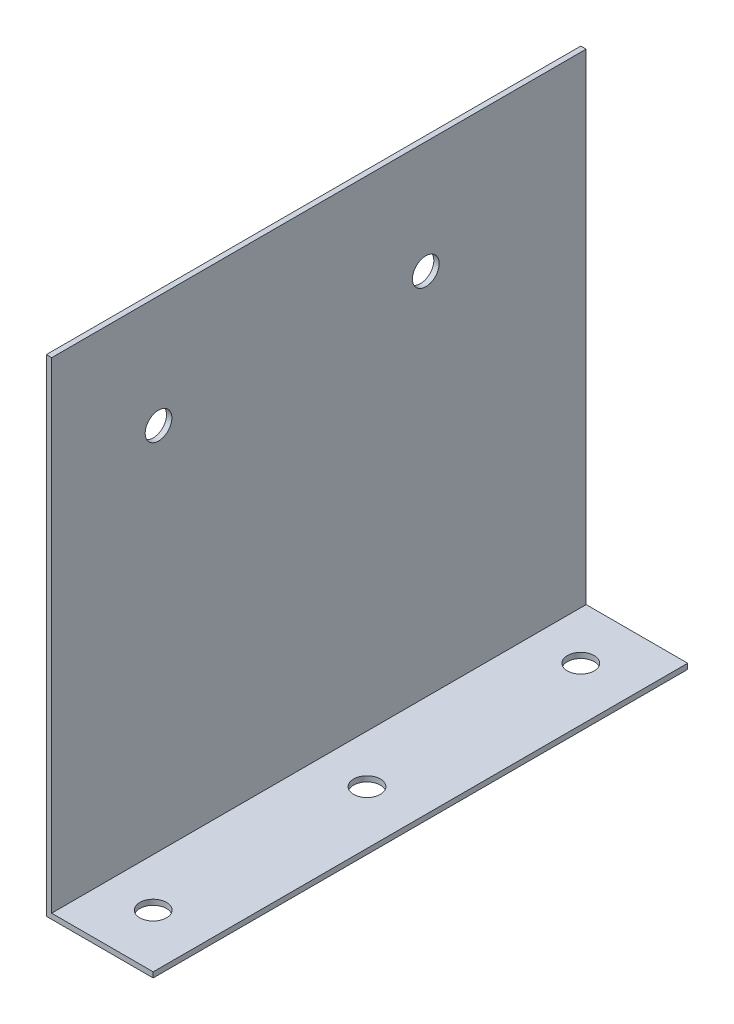
ISO-10303-21;
HEADER;
FILE_DESCRIPTION(('STEP AP214'),'2;1');
FILE_NAME('part.step','',(''),(''),'','','');
FILE_SCHEMA(('AUTOMOTIVE_DESIGN { 1 0 10303 214 1 1 1 1 }'));
ENDSEC;
DATA;
#1=APPLICATION_CONTEXT('core data for automotive mechanical design processes');
#2=APPLICATION_PROTOCOL_DEFINITION('international standard','automotive_design',2000,#1);
#3=PRODUCT_CONTEXT('',#1,'mechanical');
#4=PRODUCT('Part','Part','',(#3));
#5=PRODUCT_RELATED_PRODUCT_CATEGORY('part','',(#4));
#6=PRODUCT_DEFINITION_FORMATION('','',#4);
#7=PRODUCT_DEFINITION_CONTEXT('part definition',#1,'design');
#8=PRODUCT_DEFINITION('design','',#6,#7);
#9=PRODUCT_DEFINITION_SHAPE('','',#8);
#10=(LENGTH_UNIT() NAMED_UNIT(*) SI_UNIT(.MILLI.,.METRE.));
#11=(NAMED_UNIT(*) PLANE_ANGLE_UNIT() SI_UNIT($,.RADIAN.));
#12=(NAMED_UNIT(*) SI_UNIT($,.STERADIAN.) SOLID_ANGLE_UNIT());
#13=UNCERTAINTY_MEASURE_WITH_UNIT(LENGTH_MEASURE(1.E-05),#10,'distance_accuracy_value','');
#14=(GEOMETRIC_REPRESENTATION_CONTEXT(3) GLOBAL_UNCERTAINTY_ASSIGNED_CONTEXT((#13)) GLOBAL_UNIT_ASSIGNED_CONTEXT((#10,
#11,#12)) REPRESENTATION_CONTEXT('',''));
#15=CARTESIAN_POINT('',(0.,0.,0.));
#16=DIRECTION('',(0.,0.,1.));
#17=DIRECTION('',(1.,0.,0.));
#18=AXIS2_PLACEMENT_3D('',#15,#16,#17);
#19=CARTESIAN_POINT('',(0.,1.,0.));
#20=DIRECTION('',(0.,1.,0.));
#21=DIRECTION('',(0.,0.,1.));
#22=AXIS2_PLACEMENT_3D('',#19,#20,#21);
#23=PLANE('',#22);
#24=CARTESIAN_POINT('',(10.,1.,50.));
#25=DIRECTION('',(0.,1.,0.));
#26=DIRECTION('',(0.,0.,1.));
#27=AXIS2_PLACEMENT_3D('',#24,#25,#26);
#28=CIRCLE('',#27,2.5);
#29=CARTESIAN_POINT('',(10.,1.,52.5));
#30=VERTEX_POINT('',#29);
#31=EDGE_CURVE('E121',#30,#30,#28,.T.);
#32=ORIENTED_EDGE('',*,*,#31,.F.);
#33=EDGE_LOOP('',(#32));
#34=FACE_BOUND('',#33,.T.);
#35=CARTESIAN_POINT('',(10.,1.,10.));
#36=DIRECTION('',(0.,1.,0.));
#37=DIRECTION('',(0.,0.,1.));
#38=AXIS2_PLACEMENT_3D('',#35,#36,#37);
#39=CIRCLE('',#38,2.5);
#40=CARTESIAN_POINT('',(10.,1.,12.5));
#41=VERTEX_POINT('',#40);
#42=EDGE_CURVE('E126',#41,#41,#39,.T.);
#43=ORIENTED_EDGE('',*,*,#42,.F.);
#44=EDGE_LOOP('',(#43));
#45=FACE_BOUND('',#44,.T.);
#46=CARTESIAN_POINT('',(10.,1.,90.));
#47=DIRECTION('',(0.,1.,0.));
#48=DIRECTION('',(0.,0.,1.));
#49=AXIS2_PLACEMENT_3D('',#46,#47,#48);
#50=CIRCLE('',#49,2.5);
#51=CARTESIAN_POINT('',(10.,1.,92.5));
#52=VERTEX_POINT('',#51);
#53=EDGE_CURVE('E118',#52,#52,#50,.T.);
#54=ORIENTED_EDGE('',*,*,#53,.F.);
#55=EDGE_LOOP('',(#54));
#56=FACE_BOUND('',#55,.T.);
#57=DIRECTION('',(-1.,0.,0.));
#58=VECTOR('',#57,1.);
#59=CARTESIAN_POINT('',(0.,1.,0.));
#60=LINE('',#59,#58);
#61=CARTESIAN_POINT('',(20.,1.,0.));
#62=VERTEX_POINT('',#61);
#63=CARTESIAN_POINT('',(1.,1.,0.));
#64=VERTEX_POINT('',#63);
#65=EDGE_CURVE('E100',#62,#64,#60,.T.);
#66=ORIENTED_EDGE('',*,*,#65,.T.);
#67=DIRECTION('',(0.,0.,1.));
#68=VECTOR('',#67,1.);
#69=CARTESIAN_POINT('',(1.,1.,0.));
#70=LINE('',#69,#68);
#71=CARTESIAN_POINT('',(1.00000000000001,1.,100.));
#72=VERTEX_POINT('',#71);
#73=EDGE_CURVE('E117',#64,#72,#70,.T.);
#74=ORIENTED_EDGE('',*,*,#73,.T.);
#75=DIRECTION('',(1.,0.,0.));
#76=VECTOR('',#75,1.);
#77=CARTESIAN_POINT('',(0.,1.,100.));
#78=LINE('',#77,#76);
#79=CARTESIAN_POINT('',(20.,1.,100.));
#80=VERTEX_POINT('',#79);
#81=EDGE_CURVE('E90',#72,#80,#78,.T.);
#82=ORIENTED_EDGE('',*,*,#81,.T.);
#83=DIRECTION('',(0.,0.,-1.));
#84=VECTOR('',#83,1.);
#85=CARTESIAN_POINT('',(20.,1.,0.));
#86=LINE('',#85,#84);
#87=EDGE_CURVE('E59',#80,#62,#86,.T.);
#88=ORIENTED_EDGE('',*,*,#87,.T.);
#89=EDGE_LOOP('',(#66,#74,#82,#88));
#90=FACE_BOUND('',#89,.T.);
#91=ADVANCED_FACE('F33',(#34,#45,#56,#90),#23,.T.);
#92=CARTESIAN_POINT('',(0.,1.,0.));
#93=DIRECTION('',(1.,0.,0.));
#94=DIRECTION('',(0.,0.,-1.));
#95=AXIS2_PLACEMENT_3D('',#92,#93,#94);
#96=PLANE('',#95);
#97=CARTESIAN_POINT('',(0.,70.,80.));
#98=DIRECTION('',(1.,0.,0.));
#99=DIRECTION('',(0.,0.,-1.));
#100=AXIS2_PLACEMENT_3D('',#97,#98,#99);
#101=CIRCLE('',#100,2.50000000000001);
#102=CARTESIAN_POINT('',(0.,70.,77.5));
#103=VERTEX_POINT('',#102);
#104=EDGE_CURVE('E282',#103,#103,#101,.T.);
#105=ORIENTED_EDGE('',*,*,#104,.T.);
#106=EDGE_LOOP('',(#105));
#107=FACE_BOUND('',#106,.T.);
#108=CARTESIAN_POINT('',(0.,70.,30.));
#109=DIRECTION('',(1.,0.,0.));
#110=DIRECTION('',(0.,0.,-1.));
#111=AXIS2_PLACEMENT_3D('',#108,#109,#110);
#112=CIRCLE('',#111,2.5);
#113=CARTESIAN_POINT('',(0.,70.,27.5));
#114=VERTEX_POINT('',#113);
#115=EDGE_CURVE('E131',#114,#114,#112,.T.);
#116=ORIENTED_EDGE('',*,*,#115,.T.);
#117=EDGE_LOOP('',(#116));
#118=FACE_BOUND('',#117,.T.);
#119=DIRECTION('',(0.,0.,1.));
#120=VECTOR('',#119,1.);
#121=CARTESIAN_POINT('',(0.,0.,0.));
#122=LINE('',#121,#120);
#123=CARTESIAN_POINT('',(0.,0.,0.));
#124=VERTEX_POINT('',#123);
#125=CARTESIAN_POINT('',(0.,0.,100.));
#126=VERTEX_POINT('',#125);
#127=EDGE_CURVE('E96',#124,#126,#122,.T.);
#128=ORIENTED_EDGE('',*,*,#127,.T.);
#129=DIRECTION('',(0.,-1.,0.));
#130=VECTOR('',#129,1.);
#131=CARTESIAN_POINT('',(0.,1.,100.));
#132=LINE('',#131,#130);
#133=CARTESIAN_POINT('',(0.,91.,100.));
#134=VERTEX_POINT('',#133);
#135=EDGE_CURVE('E11',#134,#126,#132,.T.);
#136=ORIENTED_EDGE('',*,*,#135,.F.);
#137=DIRECTION('',(0.,0.,1.));
#138=VECTOR('',#137,1.);
#139=CARTESIAN_POINT('',(0.,91.,0.));
#140=LINE('',#139,#138);
#141=CARTESIAN_POINT('',(0.,91.,0.));
#142=VERTEX_POINT('',#141);
#143=EDGE_CURVE('E98',#142,#134,#140,.T.);
#144=ORIENTED_EDGE('',*,*,#143,.F.);
#145=DIRECTION('',(0.,-1.,0.));
#146=VECTOR('',#145,1.);
#147=CARTESIAN_POINT('',(0.,1.,0.));
#148=LINE('',#147,#146);
#149=EDGE_CURVE('E83',#142,#124,#148,.T.);
#150=ORIENTED_EDGE('',*,*,#149,.T.);
#151=EDGE_LOOP('',(#128,#136,#144,#150));
#152=FACE_BOUND('',#151,.T.);
#153=ADVANCED_FACE('F35',(#107,#118,#152),#96,.F.);
#154=CARTESIAN_POINT('',(0.,1.,100.));
#155=DIRECTION('',(0.,0.,-1.));
#156=DIRECTION('',(-1.,0.,0.));
#157=AXIS2_PLACEMENT_3D('',#154,#155,#156);
#158=PLANE('',#157);
#159=DIRECTION('',(1.,0.,0.));
#160=VECTOR('',#159,1.);
#161=CARTESIAN_POINT('',(0.,0.,100.));
#162=LINE('',#161,#160);
#163=CARTESIAN_POINT('',(20.,0.,100.));
#164=VERTEX_POINT('',#163);
#165=EDGE_CURVE('E103',#126,#164,#162,.T.);
#166=ORIENTED_EDGE('',*,*,#165,.T.);
#167=DIRECTION('',(0.,-1.,0.));
#168=VECTOR('',#167,1.);
#169=CARTESIAN_POINT('',(20.,1.,100.));
#170=LINE('',#169,#168);
#171=EDGE_CURVE('E42',#80,#164,#170,.T.);
#172=ORIENTED_EDGE('',*,*,#171,.F.);
#173=ORIENTED_EDGE('',*,*,#81,.F.);
#174=DIRECTION('',(0.,-1.,0.));
#175=VECTOR('',#174,1.);
#176=CARTESIAN_POINT('',(1.00000000000001,91.,100.));
#177=LINE('',#176,#175);
#178=CARTESIAN_POINT('',(1.00000000000001,91.,100.));
#179=VERTEX_POINT('',#178);
#180=EDGE_CURVE('E50',#179,#72,#177,.T.);
#181=ORIENTED_EDGE('',*,*,#180,.F.);
#182=DIRECTION('',(1.,0.,0.));
#183=VECTOR('',#182,1.);
#184=CARTESIAN_POINT('',(0.,91.,100.));
#185=LINE('',#184,#183);
#186=EDGE_CURVE('E142',#134,#179,#185,.T.);
#187=ORIENTED_EDGE('',*,*,#186,.F.);
#188=ORIENTED_EDGE('',*,*,#135,.T.);
#189=EDGE_LOOP('',(#166,#172,#173,#181,#187,#188));
#190=FACE_BOUND('',#189,.T.);
#191=ADVANCED_FACE('F176',(#190),#158,.F.);
#192=CARTESIAN_POINT('',(20.,1.,0.));
#193=DIRECTION('',(-1.,0.,0.));
#194=DIRECTION('',(0.,0.,1.));
#195=AXIS2_PLACEMENT_3D('',#192,#193,#194);
#196=PLANE('',#195);
#197=DIRECTION('',(0.,0.,-1.));
#198=VECTOR('',#197,1.);
#199=CARTESIAN_POINT('',(20.,0.,0.));
#200=LINE('',#199,#198);
#201=CARTESIAN_POINT('',(20.,0.,0.));
#202=VERTEX_POINT('',#201);
#203=EDGE_CURVE('E91',#164,#202,#200,.T.);
#204=ORIENTED_EDGE('',*,*,#203,.T.);
#205=DIRECTION('',(0.,-1.,0.));
#206=VECTOR('',#205,1.);
#207=CARTESIAN_POINT('',(20.,1.,0.));
#208=LINE('',#207,#206);
#209=EDGE_CURVE('E86',#62,#202,#208,.T.);
#210=ORIENTED_EDGE('',*,*,#209,.F.);
#211=ORIENTED_EDGE('',*,*,#87,.F.);
#212=ORIENTED_EDGE('',*,*,#171,.T.);
#213=EDGE_LOOP('',(#204,#210,#211,#212));
#214=FACE_BOUND('',#213,.T.);
#215=ADVANCED_FACE('F182',(#214),#196,.F.);
#216=CARTESIAN_POINT('',(0.,1.,0.));
#217=DIRECTION('',(0.,0.,1.));
#218=DIRECTION('',(1.,0.,0.));
#219=AXIS2_PLACEMENT_3D('',#216,#217,#218);
#220=PLANE('',#219);
#221=DIRECTION('',(-1.,0.,0.));
#222=VECTOR('',#221,1.);
#223=CARTESIAN_POINT('',(0.,0.,0.));
#224=LINE('',#223,#222);
#225=EDGE_CURVE('E79',#202,#124,#224,.T.);
#226=ORIENTED_EDGE('',*,*,#225,.T.);
#227=ORIENTED_EDGE('',*,*,#149,.F.);
#228=DIRECTION('',(1.,0.,0.));
#229=VECTOR('',#228,1.);
#230=CARTESIAN_POINT('',(0.,91.,0.));
#231=LINE('',#230,#229);
#232=CARTESIAN_POINT('',(1.,91.,0.));
#233=VERTEX_POINT('',#232);
#234=EDGE_CURVE('E138',#142,#233,#231,.T.);
#235=ORIENTED_EDGE('',*,*,#234,.T.);
#236=DIRECTION('',(0.,-1.,0.));
#237=VECTOR('',#236,1.);
#238=CARTESIAN_POINT('',(1.,91.,0.));
#239=LINE('',#238,#237);
#240=EDGE_CURVE('E106',#233,#64,#239,.T.);
#241=ORIENTED_EDGE('',*,*,#240,.T.);
#242=ORIENTED_EDGE('',*,*,#65,.F.);
#243=ORIENTED_EDGE('',*,*,#209,.T.);
#244=EDGE_LOOP('',(#226,#227,#235,#241,#242,#243));
#245=FACE_BOUND('',#244,.T.);
#246=ADVANCED_FACE('F81',(#245),#220,.F.);
#247=CARTESIAN_POINT('',(0.,0.,0.));
#248=DIRECTION('',(0.,1.,0.));
#249=DIRECTION('',(0.,0.,1.));
#250=AXIS2_PLACEMENT_3D('',#247,#248,#249);
#251=PLANE('',#250);
#252=CARTESIAN_POINT('',(10.,0.,50.));
#253=DIRECTION('',(0.,1.,0.));
#254=DIRECTION('',(0.,0.,1.));
#255=AXIS2_PLACEMENT_3D('',#252,#253,#254);
#256=CIRCLE('',#255,2.5);
#257=CARTESIAN_POINT('',(10.,0.,52.5));
#258=VERTEX_POINT('',#257);
#259=EDGE_CURVE('E37',#258,#258,#256,.T.);
#260=ORIENTED_EDGE('',*,*,#259,.T.);
#261=EDGE_LOOP('',(#260));
#262=FACE_BOUND('',#261,.T.);
#263=CARTESIAN_POINT('',(10.,0.,10.));
#264=DIRECTION('',(0.,1.,0.));
#265=DIRECTION('',(0.,0.,1.));
#266=AXIS2_PLACEMENT_3D('',#263,#264,#265);
#267=CIRCLE('',#266,2.5);
#268=CARTESIAN_POINT('',(10.,0.,12.5));
#269=VERTEX_POINT('',#268);
#270=EDGE_CURVE('E119',#269,#269,#267,.T.);
#271=ORIENTED_EDGE('',*,*,#270,.T.);
#272=EDGE_LOOP('',(#271));
#273=FACE_BOUND('',#272,.T.);
#274=CARTESIAN_POINT('',(10.,0.,90.));
#275=DIRECTION('',(0.,1.,0.));
#276=DIRECTION('',(0.,0.,1.));
#277=AXIS2_PLACEMENT_3D('',#274,#275,#276);
#278=CIRCLE('',#277,2.5);
#279=CARTESIAN_POINT('',(10.,0.,92.5));
#280=VERTEX_POINT('',#279);
#281=EDGE_CURVE('E115',#280,#280,#278,.T.);
#282=ORIENTED_EDGE('',*,*,#281,.T.);
#283=EDGE_LOOP('',(#282));
#284=FACE_BOUND('',#283,.T.);
#285=ORIENTED_EDGE('',*,*,#127,.F.);
#286=ORIENTED_EDGE('',*,*,#225,.F.);
#287=ORIENTED_EDGE('',*,*,#203,.F.);
#288=ORIENTED_EDGE('',*,*,#165,.F.);
#289=EDGE_LOOP('',(#285,#286,#287,#288));
#290=FACE_BOUND('',#289,.T.);
#291=ADVANCED_FACE('F102',(#262,#273,#284,#290),#251,.F.);
#292=CARTESIAN_POINT('',(1.,91.,0.));
#293=DIRECTION('',(1.,0.,0.));
#294=DIRECTION('',(0.,0.,-1.));
#295=AXIS2_PLACEMENT_3D('',#292,#293,#294);
#296=PLANE('',#295);
#297=CARTESIAN_POINT('',(1.00000000000001,70.,80.));
#298=DIRECTION('',(1.,0.,0.));
#299=DIRECTION('',(0.,0.,-1.));
#300=AXIS2_PLACEMENT_3D('',#297,#298,#299);
#301=CIRCLE('',#300,2.50000000000001);
#302=CARTESIAN_POINT('',(1.00000000000001,70.,77.5));
#303=VERTEX_POINT('',#302);
#304=EDGE_CURVE('E279',#303,#303,#301,.T.);
#305=ORIENTED_EDGE('',*,*,#304,.F.);
#306=EDGE_LOOP('',(#305));
#307=FACE_BOUND('',#306,.T.);
#308=CARTESIAN_POINT('',(1.,70.,30.));
#309=DIRECTION('',(1.,0.,0.));
#310=DIRECTION('',(0.,0.,-1.));
#311=AXIS2_PLACEMENT_3D('',#308,#309,#310);
#312=CIRCLE('',#311,2.5);
#313=CARTESIAN_POINT('',(1.,70.,27.5));
#314=VERTEX_POINT('',#313);
#315=EDGE_CURVE('E283',#314,#314,#312,.T.);
#316=ORIENTED_EDGE('',*,*,#315,.F.);
#317=EDGE_LOOP('',(#316));
#318=FACE_BOUND('',#317,.T.);
#319=ORIENTED_EDGE('',*,*,#73,.F.);
#320=ORIENTED_EDGE('',*,*,#240,.F.);
#321=DIRECTION('',(0.,0.,1.));
#322=VECTOR('',#321,1.);
#323=CARTESIAN_POINT('',(1.,91.,0.));
#324=LINE('',#323,#322);
#325=EDGE_CURVE('E140',#233,#179,#324,.T.);
#326=ORIENTED_EDGE('',*,*,#325,.T.);
#327=ORIENTED_EDGE('',*,*,#180,.T.);
#328=EDGE_LOOP('',(#319,#320,#326,#327));
#329=FACE_BOUND('',#328,.T.);
#330=ADVANCED_FACE('F154',(#307,#318,#329),#296,.T.);
#331=CARTESIAN_POINT('',(0.,91.,0.));
#332=DIRECTION('',(0.,-1.,0.));
#333=DIRECTION('',(0.,0.,-1.));
#334=AXIS2_PLACEMENT_3D('',#331,#332,#333);
#335=PLANE('',#334);
#336=ORIENTED_EDGE('',*,*,#234,.F.);
#337=ORIENTED_EDGE('',*,*,#143,.T.);
#338=ORIENTED_EDGE('',*,*,#186,.T.);
#339=ORIENTED_EDGE('',*,*,#325,.F.);
#340=EDGE_LOOP('',(#336,#337,#338,#339));
#341=FACE_BOUND('',#340,.T.);
#342=ADVANCED_FACE('F156',(#341),#335,.F.);
#343=CARTESIAN_POINT('',(10.,-41.,90.));
#344=DIRECTION('',(0.,1.,0.));
#345=DIRECTION('',(0.,0.,1.));
#346=AXIS2_PLACEMENT_3D('',#343,#344,#345);
#347=CYLINDRICAL_SURFACE('',#346,2.5);
#348=ORIENTED_EDGE('',*,*,#53,.T.);
#349=EDGE_LOOP('',(#348));
#350=FACE_BOUND('',#349,.T.);
#351=ORIENTED_EDGE('',*,*,#281,.F.);
#352=EDGE_LOOP('',(#351));
#353=FACE_BOUND('',#352,.T.);
#354=ADVANCED_FACE('F163',(#350,#353),#347,.F.);
#355=CARTESIAN_POINT('',(10.,-41.,10.));
#356=DIRECTION('',(0.,1.,0.));
#357=DIRECTION('',(0.,0.,1.));
#358=AXIS2_PLACEMENT_3D('',#355,#356,#357);
#359=CYLINDRICAL_SURFACE('',#358,2.5);
#360=ORIENTED_EDGE('',*,*,#42,.T.);
#361=EDGE_LOOP('',(#360));
#362=FACE_BOUND('',#361,.T.);
#363=ORIENTED_EDGE('',*,*,#270,.F.);
#364=EDGE_LOOP('',(#363));
#365=FACE_BOUND('',#364,.T.);
#366=ADVANCED_FACE('F224',(#362,#365),#359,.F.);
#367=CARTESIAN_POINT('',(10.,-41.,50.));
#368=DIRECTION('',(0.,1.,0.));
#369=DIRECTION('',(0.,0.,1.));
#370=AXIS2_PLACEMENT_3D('',#367,#368,#369);
#371=CYLINDRICAL_SURFACE('',#370,2.5);
#372=ORIENTED_EDGE('',*,*,#31,.T.);
#373=EDGE_LOOP('',(#372));
#374=FACE_BOUND('',#373,.T.);
#375=ORIENTED_EDGE('',*,*,#259,.F.);
#376=EDGE_LOOP('',(#375));
#377=FACE_BOUND('',#376,.T.);
#378=ADVANCED_FACE('F235',(#374,#377),#371,.F.);
#379=CARTESIAN_POINT('',(-41.,70.,30.));
#380=DIRECTION('',(1.,0.,0.));
#381=DIRECTION('',(0.,0.,-1.));
#382=AXIS2_PLACEMENT_3D('',#379,#380,#381);
#383=CYLINDRICAL_SURFACE('',#382,2.5);
#384=ORIENTED_EDGE('',*,*,#315,.T.);
#385=EDGE_LOOP('',(#384));
#386=FACE_BOUND('',#385,.T.);
#387=ORIENTED_EDGE('',*,*,#115,.F.);
#388=EDGE_LOOP('',(#387));
#389=FACE_BOUND('',#388,.T.);
#390=ADVANCED_FACE('F244',(#386,#389),#383,.F.);
#391=CARTESIAN_POINT('',(-41.,70.,80.));
#392=DIRECTION('',(1.,0.,0.));
#393=DIRECTION('',(0.,0.,-1.));
#394=AXIS2_PLACEMENT_3D('',#391,#392,#393);
#395=CYLINDRICAL_SURFACE('',#394,2.50000000000001);
#396=ORIENTED_EDGE('',*,*,#304,.T.);
#397=EDGE_LOOP('',(#396));
#398=FACE_BOUND('',#397,.T.);
#399=ORIENTED_EDGE('',*,*,#104,.F.);
#400=EDGE_LOOP('',(#399));
#401=FACE_BOUND('',#400,.T.);
#402=ADVANCED_FACE('F263',(#398,#401),#395,.F.);
#403=CLOSED_SHELL('',(#91,#153,#191,#215,#246,#291,#330,#342,#354,#366,#378,#390,#402));
#404=MANIFOLD_SOLID_BREP('B2',#403);
#405=ADVANCED_BREP_SHAPE_REPRESENTATION('',(#18,#404),#14);
#406=SHAPE_DEFINITION_REPRESENTATION(#9,#405);
ENDSEC;
END-ISO-10303-21;
